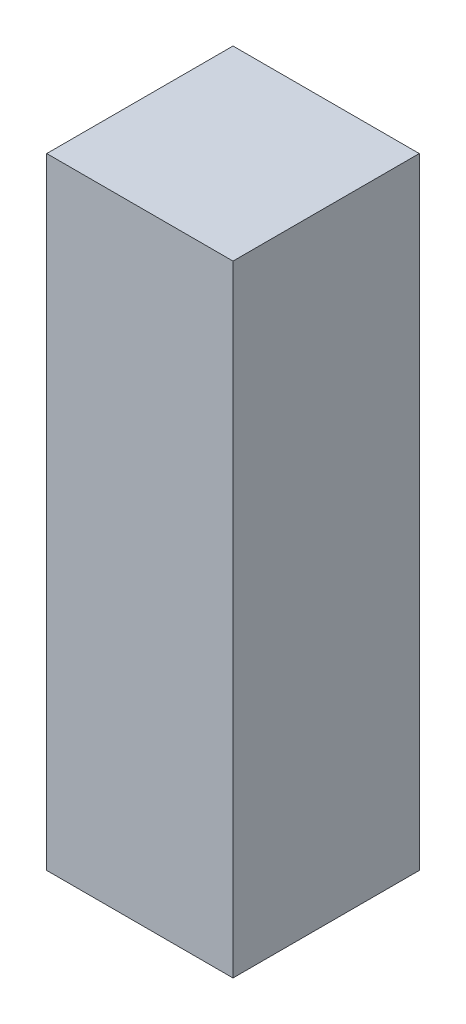
ISO-10303-21;
HEADER;
FILE_DESCRIPTION(('STEP AP214'),'2;1');
FILE_NAME('part.step','',(''),(''),'','','');
FILE_SCHEMA(('AUTOMOTIVE_DESIGN { 1 0 10303 214 1 1 1 1 }'));
ENDSEC;
DATA;
#1=APPLICATION_CONTEXT('core data for automotive mechanical design processes');
#2=APPLICATION_PROTOCOL_DEFINITION('international standard','automotive_design',2000,#1);
#3=PRODUCT_CONTEXT('',#1,'mechanical');
#4=PRODUCT('Part','Part','',(#3));
#5=PRODUCT_RELATED_PRODUCT_CATEGORY('part','',(#4));
#6=PRODUCT_DEFINITION_FORMATION('','',#4);
#7=PRODUCT_DEFINITION_CONTEXT('part definition',#1,'design');
#8=PRODUCT_DEFINITION('design','',#6,#7);
#9=PRODUCT_DEFINITION_SHAPE('','',#8);
#10=(LENGTH_UNIT() NAMED_UNIT(*) SI_UNIT(.MILLI.,.METRE.));
#11=(NAMED_UNIT(*) PLANE_ANGLE_UNIT() SI_UNIT($,.RADIAN.));
#12=(NAMED_UNIT(*) SI_UNIT($,.STERADIAN.) SOLID_ANGLE_UNIT());
#13=UNCERTAINTY_MEASURE_WITH_UNIT(LENGTH_MEASURE(1.E-05),#10,'distance_accuracy_value','');
#14=(GEOMETRIC_REPRESENTATION_CONTEXT(3) GLOBAL_UNCERTAINTY_ASSIGNED_CONTEXT((#13)) GLOBAL_UNIT_ASSIGNED_CONTEXT((#10,
#11,#12)) REPRESENTATION_CONTEXT('',''));
#15=CARTESIAN_POINT('',(0.,0.,0.));
#16=DIRECTION('',(0.,0.,1.));
#17=DIRECTION('',(1.,0.,0.));
#18=AXIS2_PLACEMENT_3D('',#15,#16,#17);
#19=CARTESIAN_POINT('',(8.5725,28.575,-8.5725));
#20=DIRECTION('',(-1.,0.,0.));
#21=DIRECTION('',(0.,0.,1.));
#22=AXIS2_PLACEMENT_3D('',#19,#20,#21);
#23=PLANE('',#22);
#24=DIRECTION('',(0.,0.,-1.));
#25=VECTOR('',#24,1.);
#26=CARTESIAN_POINT('',(8.5725,-28.575,-8.5725));
#27=LINE('',#26,#25);
#28=CARTESIAN_POINT('',(8.5725,-28.575,8.5725));
#29=VERTEX_POINT('',#28);
#30=CARTESIAN_POINT('',(8.5725,-28.575,-8.5725));
#31=VERTEX_POINT('',#30);
#32=EDGE_CURVE('E107',#29,#31,#27,.T.);
#33=ORIENTED_EDGE('',*,*,#32,.T.);
#34=DIRECTION('',(0.,-1.,0.));
#35=VECTOR('',#34,1.);
#36=CARTESIAN_POINT('',(8.5725,28.575,-8.5725));
#37=LINE('',#36,#35);
#38=CARTESIAN_POINT('',(8.5725,28.575,-8.5725));
#39=VERTEX_POINT('',#38);
#40=EDGE_CURVE('E11',#39,#31,#37,.T.);
#41=ORIENTED_EDGE('',*,*,#40,.F.);
#42=DIRECTION('',(0.,0.,-1.));
#43=VECTOR('',#42,1.);
#44=CARTESIAN_POINT('',(8.5725,28.575,-8.5725));
#45=LINE('',#44,#43);
#46=CARTESIAN_POINT('',(8.5725,28.575,8.5725));
#47=VERTEX_POINT('',#46);
#48=EDGE_CURVE('E91',#47,#39,#45,.T.);
#49=ORIENTED_EDGE('',*,*,#48,.F.);
#50=DIRECTION('',(0.,-1.,0.));
#51=VECTOR('',#50,1.);
#52=CARTESIAN_POINT('',(8.5725,28.575,8.5725));
#53=LINE('',#52,#51);
#54=EDGE_CURVE('E103',#47,#29,#53,.T.);
#55=ORIENTED_EDGE('',*,*,#54,.T.);
#56=EDGE_LOOP('',(#33,#41,#49,#55));
#57=FACE_BOUND('',#56,.T.);
#58=ADVANCED_FACE('F39',(#57),#23,.F.);
#59=CARTESIAN_POINT('',(-8.5725,28.575,-8.5725));
#60=DIRECTION('',(0.,0.,1.));
#61=DIRECTION('',(1.,0.,0.));
#62=AXIS2_PLACEMENT_3D('',#59,#60,#61);
#63=PLANE('',#62);
#64=DIRECTION('',(-1.,0.,0.));
#65=VECTOR('',#64,1.);
#66=CARTESIAN_POINT('',(-8.5725,-28.575,-8.5725));
#67=LINE('',#66,#65);
#68=CARTESIAN_POINT('',(-8.5725,-28.575,-8.5725));
#69=VERTEX_POINT('',#68);
#70=EDGE_CURVE('E96',#31,#69,#67,.T.);
#71=ORIENTED_EDGE('',*,*,#70,.T.);
#72=DIRECTION('',(0.,-1.,0.));
#73=VECTOR('',#72,1.);
#74=CARTESIAN_POINT('',(-8.5725,28.575,-8.5725));
#75=LINE('',#74,#73);
#76=CARTESIAN_POINT('',(-8.5725,28.575,-8.5725));
#77=VERTEX_POINT('',#76);
#78=EDGE_CURVE('E48',#77,#69,#75,.T.);
#79=ORIENTED_EDGE('',*,*,#78,.F.);
#80=DIRECTION('',(-1.,0.,0.));
#81=VECTOR('',#80,1.);
#82=CARTESIAN_POINT('',(-8.5725,28.575,-8.5725));
#83=LINE('',#82,#81);
#84=EDGE_CURVE('E86',#39,#77,#83,.T.);
#85=ORIENTED_EDGE('',*,*,#84,.F.);
#86=ORIENTED_EDGE('',*,*,#40,.T.);
#87=EDGE_LOOP('',(#71,#79,#85,#86));
#88=FACE_BOUND('',#87,.T.);
#89=ADVANCED_FACE('F95',(#88),#63,.F.);
#90=CARTESIAN_POINT('',(-8.5725,28.575,-8.5725));
#91=DIRECTION('',(1.,0.,0.));
#92=DIRECTION('',(0.,0.,-1.));
#93=AXIS2_PLACEMENT_3D('',#90,#91,#92);
#94=PLANE('',#93);
#95=DIRECTION('',(0.,0.,1.));
#96=VECTOR('',#95,1.);
#97=CARTESIAN_POINT('',(-8.5725,-28.575,-8.5725));
#98=LINE('',#97,#96);
#99=CARTESIAN_POINT('',(-8.5725,-28.575,8.5725));
#100=VERTEX_POINT('',#99);
#101=EDGE_CURVE('E73',#69,#100,#98,.T.);
#102=ORIENTED_EDGE('',*,*,#101,.T.);
#103=DIRECTION('',(0.,-1.,0.));
#104=VECTOR('',#103,1.);
#105=CARTESIAN_POINT('',(-8.5725,28.575,8.5725));
#106=LINE('',#105,#104);
#107=CARTESIAN_POINT('',(-8.5725,28.575,8.5725));
#108=VERTEX_POINT('',#107);
#109=EDGE_CURVE('E98',#108,#100,#106,.T.);
#110=ORIENTED_EDGE('',*,*,#109,.F.);
#111=DIRECTION('',(0.,0.,1.));
#112=VECTOR('',#111,1.);
#113=CARTESIAN_POINT('',(-8.5725,28.575,-8.5725));
#114=LINE('',#113,#112);
#115=EDGE_CURVE('E89',#77,#108,#114,.T.);
#116=ORIENTED_EDGE('',*,*,#115,.F.);
#117=ORIENTED_EDGE('',*,*,#78,.T.);
#118=EDGE_LOOP('',(#102,#110,#116,#117));
#119=FACE_BOUND('',#118,.T.);
#120=ADVANCED_FACE('F99',(#119),#94,.F.);
#121=CARTESIAN_POINT('',(-8.5725,28.575,8.5725));
#122=DIRECTION('',(0.,0.,-1.));
#123=DIRECTION('',(-1.,0.,0.));
#124=AXIS2_PLACEMENT_3D('',#121,#122,#123);
#125=PLANE('',#124);
#126=DIRECTION('',(1.,0.,0.));
#127=VECTOR('',#126,1.);
#128=CARTESIAN_POINT('',(-8.5725,-28.575,8.5725));
#129=LINE('',#128,#127);
#130=EDGE_CURVE('E79',#100,#29,#129,.T.);
#131=ORIENTED_EDGE('',*,*,#130,.T.);
#132=ORIENTED_EDGE('',*,*,#54,.F.);
#133=DIRECTION('',(1.,0.,0.));
#134=VECTOR('',#133,1.);
#135=CARTESIAN_POINT('',(-8.5725,28.575,8.5725));
#136=LINE('',#135,#134);
#137=EDGE_CURVE('E56',#108,#47,#136,.T.);
#138=ORIENTED_EDGE('',*,*,#137,.F.);
#139=ORIENTED_EDGE('',*,*,#109,.T.);
#140=EDGE_LOOP('',(#131,#132,#138,#139));
#141=FACE_BOUND('',#140,.T.);
#142=ADVANCED_FACE('F120',(#141),#125,.F.);
#143=CARTESIAN_POINT('',(0.,28.575,0.));
#144=DIRECTION('',(0.,1.,0.));
#145=DIRECTION('',(0.,0.,1.));
#146=AXIS2_PLACEMENT_3D('',#143,#144,#145);
#147=PLANE('',#146);
#148=ORIENTED_EDGE('',*,*,#48,.T.);
#149=ORIENTED_EDGE('',*,*,#84,.T.);
#150=ORIENTED_EDGE('',*,*,#115,.T.);
#151=ORIENTED_EDGE('',*,*,#137,.T.);
#152=EDGE_LOOP('',(#148,#149,#150,#151));
#153=FACE_BOUND('',#152,.T.);
#154=ADVANCED_FACE('F87',(#153),#147,.T.);
#155=CARTESIAN_POINT('',(0.,-28.575,0.));
#156=DIRECTION('',(0.,1.,0.));
#157=DIRECTION('',(0.,0.,1.));
#158=AXIS2_PLACEMENT_3D('',#155,#156,#157);
#159=PLANE('',#158);
#160=ORIENTED_EDGE('',*,*,#32,.F.);
#161=ORIENTED_EDGE('',*,*,#130,.F.);
#162=ORIENTED_EDGE('',*,*,#101,.F.);
#163=ORIENTED_EDGE('',*,*,#70,.F.);
#164=EDGE_LOOP('',(#160,#161,#162,#163));
#165=FACE_BOUND('',#164,.T.);
#166=ADVANCED_FACE('F123',(#165),#159,.F.);
#167=CLOSED_SHELL('',(#58,#89,#120,#142,#154,#166));
#168=MANIFOLD_SOLID_BREP('B2',#167);
#169=ADVANCED_BREP_SHAPE_REPRESENTATION('',(#18,#168),#14);
#170=SHAPE_DEFINITION_REPRESENTATION(#9,#169);
ENDSEC;
END-ISO-10303-21;
